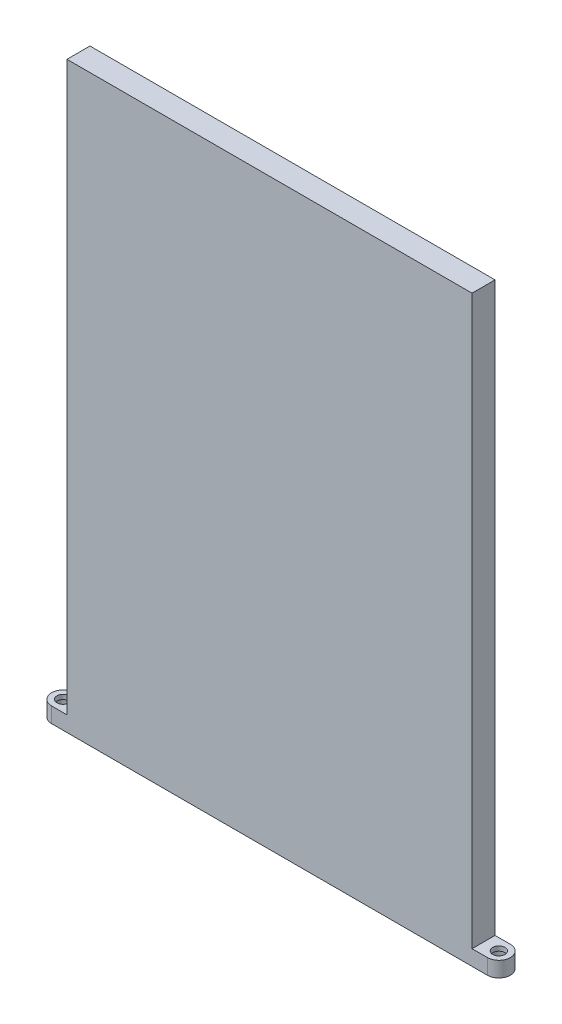
ISO-10303-21;
HEADER;
FILE_DESCRIPTION(('STEP AP214'),'2;1');
FILE_NAME('part.step','',(''),(''),'','','');
FILE_SCHEMA(('AUTOMOTIVE_DESIGN { 1 0 10303 214 1 1 1 1 }'));
ENDSEC;
DATA;
#1=APPLICATION_CONTEXT('core data for automotive mechanical design processes');
#2=APPLICATION_PROTOCOL_DEFINITION('international standard','automotive_design',2000,#1);
#3=PRODUCT_CONTEXT('',#1,'mechanical');
#4=PRODUCT('Part','Part','',(#3));
#5=PRODUCT_RELATED_PRODUCT_CATEGORY('part','',(#4));
#6=PRODUCT_DEFINITION_FORMATION('','',#4);
#7=PRODUCT_DEFINITION_CONTEXT('part definition',#1,'design');
#8=PRODUCT_DEFINITION('design','',#6,#7);
#9=PRODUCT_DEFINITION_SHAPE('','',#8);
#10=(LENGTH_UNIT() NAMED_UNIT(*) SI_UNIT(.MILLI.,.METRE.));
#11=(NAMED_UNIT(*) PLANE_ANGLE_UNIT() SI_UNIT($,.RADIAN.));
#12=(NAMED_UNIT(*) SI_UNIT($,.STERADIAN.) SOLID_ANGLE_UNIT());
#13=UNCERTAINTY_MEASURE_WITH_UNIT(LENGTH_MEASURE(1.E-05),#10,'distance_accuracy_value','');
#14=(GEOMETRIC_REPRESENTATION_CONTEXT(3) GLOBAL_UNCERTAINTY_ASSIGNED_CONTEXT((#13)) GLOBAL_UNIT_ASSIGNED_CONTEXT((#10,
#11,#12)) REPRESENTATION_CONTEXT('',''));
#15=CARTESIAN_POINT('',(0.,0.,0.));
#16=DIRECTION('',(0.,0.,1.));
#17=DIRECTION('',(1.,0.,0.));
#18=AXIS2_PLACEMENT_3D('',#15,#16,#17);
#19=CARTESIAN_POINT('',(-71.,-90.,3.75));
#20=DIRECTION('',(0.,-1.,0.));
#21=DIRECTION('',(1.,0.,0.));
#22=AXIS2_PLACEMENT_3D('',#19,#20,#21);
#23=CYLINDRICAL_SURFACE('',#22,2.);
#24=CARTESIAN_POINT('',(-71.,-90.,3.75));
#25=DIRECTION('',(0.,-1.,0.));
#26=DIRECTION('',(1.,0.,0.));
#27=AXIS2_PLACEMENT_3D('',#24,#25,#26);
#28=CIRCLE('',#27,2.);
#29=CARTESIAN_POINT('',(-69.,-90.,3.75));
#30=VERTEX_POINT('',#29);
#31=EDGE_CURVE('E142',#30,#30,#28,.T.);
#32=ORIENTED_EDGE('',*,*,#31,.F.);
#33=EDGE_LOOP('',(#32));
#34=FACE_BOUND('',#33,.T.);
#35=CARTESIAN_POINT('',(-71.,-91.5,3.75));
#36=DIRECTION('',(0.,-1.,0.));
#37=DIRECTION('',(1.,0.,0.));
#38=AXIS2_PLACEMENT_3D('',#35,#36,#37);
#39=CIRCLE('',#38,2.);
#40=CARTESIAN_POINT('',(-69.,-91.5,3.75));
#41=VERTEX_POINT('',#40);
#42=EDGE_CURVE('E202',#41,#41,#39,.F.);
#43=ORIENTED_EDGE('',*,*,#42,.F.);
#44=EDGE_LOOP('',(#43));
#45=FACE_BOUND('',#44,.T.);
#46=ADVANCED_FACE('F45',(#34,#45),#23,.F.);
#47=CARTESIAN_POINT('',(66.,-95.,7.5));
#48=DIRECTION('',(-1.,0.,0.));
#49=DIRECTION('',(0.,0.,1.));
#50=AXIS2_PLACEMENT_3D('',#47,#48,#49);
#51=PLANE('',#50);
#52=DIRECTION('',(0.,0.,1.));
#53=VECTOR('',#52,1.);
#54=CARTESIAN_POINT('',(66.,-90.,0.));
#55=LINE('',#54,#53);
#56=CARTESIAN_POINT('',(66.,-90.,0.));
#57=VERTEX_POINT('',#56);
#58=CARTESIAN_POINT('',(66.,-90.,7.5));
#59=VERTEX_POINT('',#58);
#60=EDGE_CURVE('E63',#57,#59,#55,.T.);
#61=ORIENTED_EDGE('',*,*,#60,.F.);
#62=DIRECTION('',(0.,1.,0.));
#63=VECTOR('',#62,1.);
#64=CARTESIAN_POINT('',(66.,-95.,0.));
#65=LINE('',#64,#63);
#66=CARTESIAN_POINT('',(66.,95.,0.));
#67=VERTEX_POINT('',#66);
#68=EDGE_CURVE('E195',#57,#67,#65,.T.);
#69=ORIENTED_EDGE('',*,*,#68,.T.);
#70=DIRECTION('',(0.,0.,-1.));
#71=VECTOR('',#70,1.);
#72=CARTESIAN_POINT('',(66.,95.,7.5));
#73=LINE('',#72,#71);
#74=CARTESIAN_POINT('',(66.,95.,7.5));
#75=VERTEX_POINT('',#74);
#76=EDGE_CURVE('E11',#75,#67,#73,.T.);
#77=ORIENTED_EDGE('',*,*,#76,.F.);
#78=DIRECTION('',(0.,1.,0.));
#79=VECTOR('',#78,1.);
#80=CARTESIAN_POINT('',(66.,-95.,7.5));
#81=LINE('',#80,#79);
#82=EDGE_CURVE('E184',#59,#75,#81,.T.);
#83=ORIENTED_EDGE('',*,*,#82,.F.);
#84=EDGE_LOOP('',(#61,#69,#77,#83));
#85=FACE_BOUND('',#84,.T.);
#86=ADVANCED_FACE('F250',(#85),#51,.F.);
#87=CARTESIAN_POINT('',(-66.,-95.,7.5));
#88=DIRECTION('',(1.,0.,0.));
#89=DIRECTION('',(0.,0.,-1.));
#90=AXIS2_PLACEMENT_3D('',#87,#88,#89);
#91=PLANE('',#90);
#92=DIRECTION('',(0.,0.,-1.));
#93=VECTOR('',#92,1.);
#94=CARTESIAN_POINT('',(-66.,-90.,0.));
#95=LINE('',#94,#93);
#96=CARTESIAN_POINT('',(-66.,-90.,7.5));
#97=VERTEX_POINT('',#96);
#98=CARTESIAN_POINT('',(-66.,-90.,0.));
#99=VERTEX_POINT('',#98);
#100=EDGE_CURVE('E71',#97,#99,#95,.T.);
#101=ORIENTED_EDGE('',*,*,#100,.F.);
#102=DIRECTION('',(0.,-1.,0.));
#103=VECTOR('',#102,1.);
#104=CARTESIAN_POINT('',(-66.,-95.,7.5));
#105=LINE('',#104,#103);
#106=CARTESIAN_POINT('',(-66.,95.,7.5));
#107=VERTEX_POINT('',#106);
#108=EDGE_CURVE('E178',#107,#97,#105,.T.);
#109=ORIENTED_EDGE('',*,*,#108,.F.);
#110=DIRECTION('',(0.,0.,-1.));
#111=VECTOR('',#110,1.);
#112=CARTESIAN_POINT('',(-66.,95.,7.5));
#113=LINE('',#112,#111);
#114=CARTESIAN_POINT('',(-66.,95.,0.));
#115=VERTEX_POINT('',#114);
#116=EDGE_CURVE('E55',#107,#115,#113,.T.);
#117=ORIENTED_EDGE('',*,*,#116,.T.);
#118=DIRECTION('',(0.,-1.,0.));
#119=VECTOR('',#118,1.);
#120=CARTESIAN_POINT('',(-66.,-95.,0.));
#121=LINE('',#120,#119);
#122=EDGE_CURVE('E174',#115,#99,#121,.T.);
#123=ORIENTED_EDGE('',*,*,#122,.T.);
#124=EDGE_LOOP('',(#101,#109,#117,#123));
#125=FACE_BOUND('',#124,.T.);
#126=ADVANCED_FACE('F47',(#125),#91,.F.);
#127=CARTESIAN_POINT('',(66.,-95.,7.5));
#128=DIRECTION('',(0.,1.,0.));
#129=DIRECTION('',(-1.,0.,0.));
#130=AXIS2_PLACEMENT_3D('',#127,#128,#129);
#131=PLANE('',#130);
#132=CARTESIAN_POINT('',(-71.,-95.,3.75));
#133=DIRECTION('',(0.,-1.,0.));
#134=DIRECTION('',(1.,0.,0.));
#135=AXIS2_PLACEMENT_3D('',#132,#133,#134);
#136=CIRCLE('',#135,3.00000000000001);
#137=CARTESIAN_POINT('',(-68.,-95.,3.75));
#138=VERTEX_POINT('',#137);
#139=EDGE_CURVE('E212',#138,#138,#136,.T.);
#140=ORIENTED_EDGE('',*,*,#139,.F.);
#141=EDGE_LOOP('',(#140));
#142=FACE_BOUND('',#141,.T.);
#143=CARTESIAN_POINT('',(71.,-95.,3.75));
#144=DIRECTION('',(0.,-1.,0.));
#145=DIRECTION('',(-1.,0.,0.));
#146=AXIS2_PLACEMENT_3D('',#143,#144,#145);
#147=CIRCLE('',#146,3.00000000000001);
#148=CARTESIAN_POINT('',(68.,-95.,3.75));
#149=VERTEX_POINT('',#148);
#150=EDGE_CURVE('E224',#149,#149,#147,.T.);
#151=ORIENTED_EDGE('',*,*,#150,.F.);
#152=EDGE_LOOP('',(#151));
#153=FACE_BOUND('',#152,.T.);
#154=DIRECTION('',(1.,0.,0.));
#155=VECTOR('',#154,1.);
#156=CARTESIAN_POINT('',(66.,-95.,0.));
#157=LINE('',#156,#155);
#158=CARTESIAN_POINT('',(-71.,-95.,0.));
#159=VERTEX_POINT('',#158);
#160=CARTESIAN_POINT('',(71.,-95.,0.));
#161=VERTEX_POINT('',#160);
#162=EDGE_CURVE('E192',#159,#161,#157,.T.);
#163=ORIENTED_EDGE('',*,*,#162,.T.);
#164=CARTESIAN_POINT('',(71.,-95.,3.75));
#165=DIRECTION('',(0.,-1.,0.));
#166=DIRECTION('',(1.,0.,0.));
#167=AXIS2_PLACEMENT_3D('',#164,#165,#166);
#168=CIRCLE('',#167,3.75);
#169=CARTESIAN_POINT('',(71.,-95.,7.5));
#170=VERTEX_POINT('',#169);
#171=EDGE_CURVE('E139',#170,#161,#168,.F.);
#172=ORIENTED_EDGE('',*,*,#171,.F.);
#173=DIRECTION('',(1.,0.,0.));
#174=VECTOR('',#173,1.);
#175=CARTESIAN_POINT('',(66.,-95.,7.5));
#176=LINE('',#175,#174);
#177=CARTESIAN_POINT('',(-71.,-95.,7.5));
#178=VERTEX_POINT('',#177);
#179=EDGE_CURVE('E127',#178,#170,#176,.T.);
#180=ORIENTED_EDGE('',*,*,#179,.F.);
#181=CARTESIAN_POINT('',(-71.,-95.,3.75));
#182=DIRECTION('',(0.,-1.,0.));
#183=DIRECTION('',(1.,0.,0.));
#184=AXIS2_PLACEMENT_3D('',#181,#182,#183);
#185=CIRCLE('',#184,3.75);
#186=EDGE_CURVE('E153',#159,#178,#185,.F.);
#187=ORIENTED_EDGE('',*,*,#186,.F.);
#188=EDGE_LOOP('',(#163,#172,#180,#187));
#189=FACE_BOUND('',#188,.T.);
#190=ADVANCED_FACE('F273',(#142,#153,#189),#131,.F.);
#191=CARTESIAN_POINT('',(66.,95.,7.5));
#192=DIRECTION('',(0.,-1.,0.));
#193=DIRECTION('',(1.,0.,0.));
#194=AXIS2_PLACEMENT_3D('',#191,#192,#193);
#195=PLANE('',#194);
#196=DIRECTION('',(-1.,0.,0.));
#197=VECTOR('',#196,1.);
#198=CARTESIAN_POINT('',(66.,95.,0.));
#199=LINE('',#198,#197);
#200=EDGE_CURVE('E181',#67,#115,#199,.T.);
#201=ORIENTED_EDGE('',*,*,#200,.T.);
#202=ORIENTED_EDGE('',*,*,#116,.F.);
#203=DIRECTION('',(-1.,0.,0.));
#204=VECTOR('',#203,1.);
#205=CARTESIAN_POINT('',(66.,95.,7.5));
#206=LINE('',#205,#204);
#207=EDGE_CURVE('E187',#75,#107,#206,.T.);
#208=ORIENTED_EDGE('',*,*,#207,.F.);
#209=ORIENTED_EDGE('',*,*,#76,.T.);
#210=EDGE_LOOP('',(#201,#202,#208,#209));
#211=FACE_BOUND('',#210,.T.);
#212=ADVANCED_FACE('F276',(#211),#195,.F.);
#213=CARTESIAN_POINT('',(0.,0.,7.5));
#214=DIRECTION('',(0.,0.,1.));
#215=DIRECTION('',(1.,0.,0.));
#216=AXIS2_PLACEMENT_3D('',#213,#214,#215);
#217=PLANE('',#216);
#218=ORIENTED_EDGE('',*,*,#108,.T.);
#219=DIRECTION('',(-1.,0.,0.));
#220=VECTOR('',#219,1.);
#221=CARTESIAN_POINT('',(0.,-90.,7.5));
#222=LINE('',#221,#220);
#223=CARTESIAN_POINT('',(-71.,-90.,7.5));
#224=VERTEX_POINT('',#223);
#225=EDGE_CURVE('E163',#97,#224,#222,.T.);
#226=ORIENTED_EDGE('',*,*,#225,.T.);
#227=DIRECTION('',(0.,-1.,0.));
#228=VECTOR('',#227,1.);
#229=CARTESIAN_POINT('',(-71.,-90.,7.5));
#230=LINE('',#229,#228);
#231=EDGE_CURVE('E171',#224,#178,#230,.T.);
#232=ORIENTED_EDGE('',*,*,#231,.T.);
#233=ORIENTED_EDGE('',*,*,#179,.T.);
#234=DIRECTION('',(0.,-1.,0.));
#235=VECTOR('',#234,1.);
#236=CARTESIAN_POINT('',(71.,-90.,7.5));
#237=LINE('',#236,#235);
#238=CARTESIAN_POINT('',(71.,-90.,7.5));
#239=VERTEX_POINT('',#238);
#240=EDGE_CURVE('E124',#239,#170,#237,.T.);
#241=ORIENTED_EDGE('',*,*,#240,.F.);
#242=DIRECTION('',(1.,0.,0.));
#243=VECTOR('',#242,1.);
#244=CARTESIAN_POINT('',(0.,-90.,7.49999999999999));
#245=LINE('',#244,#243);
#246=EDGE_CURVE('E113',#59,#239,#245,.T.);
#247=ORIENTED_EDGE('',*,*,#246,.F.);
#248=ORIENTED_EDGE('',*,*,#82,.T.);
#249=ORIENTED_EDGE('',*,*,#207,.T.);
#250=EDGE_LOOP('',(#218,#226,#232,#233,#241,#247,#248,#249));
#251=FACE_BOUND('',#250,.T.);
#252=ADVANCED_FACE('F125',(#251),#217,.T.);
#253=CARTESIAN_POINT('',(0.,0.,0.));
#254=DIRECTION('',(0.,0.,1.));
#255=DIRECTION('',(1.,0.,0.));
#256=AXIS2_PLACEMENT_3D('',#253,#254,#255);
#257=PLANE('',#256);
#258=ORIENTED_EDGE('',*,*,#122,.F.);
#259=ORIENTED_EDGE('',*,*,#200,.F.);
#260=ORIENTED_EDGE('',*,*,#68,.F.);
#261=DIRECTION('',(1.,0.,0.));
#262=VECTOR('',#261,1.);
#263=CARTESIAN_POINT('',(0.,-90.,0.));
#264=LINE('',#263,#262);
#265=CARTESIAN_POINT('',(71.,-90.,0.));
#266=VERTEX_POINT('',#265);
#267=EDGE_CURVE('E133',#57,#266,#264,.T.);
#268=ORIENTED_EDGE('',*,*,#267,.T.);
#269=DIRECTION('',(0.,-1.,0.));
#270=VECTOR('',#269,1.);
#271=CARTESIAN_POINT('',(71.,-90.,0.));
#272=LINE('',#271,#270);
#273=EDGE_CURVE('E132',#266,#161,#272,.T.);
#274=ORIENTED_EDGE('',*,*,#273,.T.);
#275=ORIENTED_EDGE('',*,*,#162,.F.);
#276=DIRECTION('',(0.,-1.,0.));
#277=VECTOR('',#276,1.);
#278=CARTESIAN_POINT('',(-71.,-90.,0.));
#279=LINE('',#278,#277);
#280=CARTESIAN_POINT('',(-71.,-90.,0.));
#281=VERTEX_POINT('',#280);
#282=EDGE_CURVE('E167',#281,#159,#279,.T.);
#283=ORIENTED_EDGE('',*,*,#282,.F.);
#284=DIRECTION('',(-1.,0.,0.));
#285=VECTOR('',#284,1.);
#286=CARTESIAN_POINT('',(0.,-90.,0.));
#287=LINE('',#286,#285);
#288=EDGE_CURVE('E158',#99,#281,#287,.T.);
#289=ORIENTED_EDGE('',*,*,#288,.F.);
#290=EDGE_LOOP('',(#258,#259,#260,#268,#274,#275,#283,#289));
#291=FACE_BOUND('',#290,.T.);
#292=ADVANCED_FACE('F283',(#291),#257,.F.);
#293=CARTESIAN_POINT('',(-71.,-90.,3.75));
#294=DIRECTION('',(0.,-1.,0.));
#295=DIRECTION('',(1.,0.,0.));
#296=AXIS2_PLACEMENT_3D('',#293,#294,#295);
#297=CYLINDRICAL_SURFACE('',#296,3.75);
#298=ORIENTED_EDGE('',*,*,#186,.T.);
#299=ORIENTED_EDGE('',*,*,#231,.F.);
#300=CARTESIAN_POINT('',(-71.,-90.,3.75));
#301=DIRECTION('',(0.,-1.,0.));
#302=DIRECTION('',(1.,0.,0.));
#303=AXIS2_PLACEMENT_3D('',#300,#301,#302);
#304=CIRCLE('',#303,3.75);
#305=EDGE_CURVE('E155',#281,#224,#304,.F.);
#306=ORIENTED_EDGE('',*,*,#305,.F.);
#307=ORIENTED_EDGE('',*,*,#282,.T.);
#308=EDGE_LOOP('',(#298,#299,#306,#307));
#309=FACE_BOUND('',#308,.T.);
#310=ADVANCED_FACE('F296',(#309),#297,.T.);
#311=CARTESIAN_POINT('',(0.,-90.,0.));
#312=DIRECTION('',(0.,-1.,0.));
#313=DIRECTION('',(1.,0.,0.));
#314=AXIS2_PLACEMENT_3D('',#311,#312,#313);
#315=PLANE('',#314);
#316=ORIENTED_EDGE('',*,*,#31,.T.);
#317=EDGE_LOOP('',(#316));
#318=FACE_BOUND('',#317,.T.);
#319=ORIENTED_EDGE('',*,*,#305,.T.);
#320=ORIENTED_EDGE('',*,*,#225,.F.);
#321=ORIENTED_EDGE('',*,*,#100,.T.);
#322=ORIENTED_EDGE('',*,*,#288,.T.);
#323=EDGE_LOOP('',(#319,#320,#321,#322));
#324=FACE_BOUND('',#323,.T.);
#325=ADVANCED_FACE('F291',(#318,#324),#315,.F.);
#326=CARTESIAN_POINT('',(71.,-90.,3.75));
#327=DIRECTION('',(0.,-1.,0.));
#328=DIRECTION('',(1.,0.,0.));
#329=AXIS2_PLACEMENT_3D('',#326,#327,#328);
#330=CYLINDRICAL_SURFACE('',#329,3.75);
#331=ORIENTED_EDGE('',*,*,#171,.T.);
#332=ORIENTED_EDGE('',*,*,#273,.F.);
#333=CARTESIAN_POINT('',(71.,-90.,3.75));
#334=DIRECTION('',(0.,-1.,0.));
#335=DIRECTION('',(1.,0.,0.));
#336=AXIS2_PLACEMENT_3D('',#333,#334,#335);
#337=CIRCLE('',#336,3.75);
#338=EDGE_CURVE('E118',#239,#266,#337,.F.);
#339=ORIENTED_EDGE('',*,*,#338,.F.);
#340=ORIENTED_EDGE('',*,*,#240,.T.);
#341=EDGE_LOOP('',(#331,#332,#339,#340));
#342=FACE_BOUND('',#341,.T.);
#343=ADVANCED_FACE('F135',(#342),#330,.T.);
#344=CARTESIAN_POINT('',(0.,-90.,0.));
#345=DIRECTION('',(0.,-1.,0.));
#346=DIRECTION('',(1.,0.,0.));
#347=AXIS2_PLACEMENT_3D('',#344,#345,#346);
#348=PLANE('',#347);
#349=CARTESIAN_POINT('',(71.,-90.,3.75));
#350=DIRECTION('',(0.,-1.,0.));
#351=DIRECTION('',(1.,0.,0.));
#352=AXIS2_PLACEMENT_3D('',#349,#350,#351);
#353=CIRCLE('',#352,2.);
#354=CARTESIAN_POINT('',(73.,-90.,3.75));
#355=VERTEX_POINT('',#354);
#356=EDGE_CURVE('E145',#355,#355,#353,.T.);
#357=ORIENTED_EDGE('',*,*,#356,.T.);
#358=EDGE_LOOP('',(#357));
#359=FACE_BOUND('',#358,.T.);
#360=ORIENTED_EDGE('',*,*,#338,.T.);
#361=ORIENTED_EDGE('',*,*,#267,.F.);
#362=ORIENTED_EDGE('',*,*,#60,.T.);
#363=ORIENTED_EDGE('',*,*,#246,.T.);
#364=EDGE_LOOP('',(#360,#361,#362,#363));
#365=FACE_BOUND('',#364,.T.);
#366=ADVANCED_FACE('F115',(#359,#365),#348,.F.);
#367=CARTESIAN_POINT('',(71.,-90.,3.75));
#368=DIRECTION('',(0.,-1.,0.));
#369=DIRECTION('',(1.,0.,0.));
#370=AXIS2_PLACEMENT_3D('',#367,#368,#369);
#371=CYLINDRICAL_SURFACE('',#370,2.);
#372=CARTESIAN_POINT('',(71.,-91.5,3.75));
#373=DIRECTION('',(0.,1.,0.));
#374=DIRECTION('',(-1.,0.,0.));
#375=AXIS2_PLACEMENT_3D('',#372,#373,#374);
#376=CIRCLE('',#375,2.);
#377=CARTESIAN_POINT('',(69.,-91.5,3.75));
#378=VERTEX_POINT('',#377);
#379=EDGE_CURVE('E49',#378,#378,#376,.F.);
#380=ORIENTED_EDGE('',*,*,#379,.T.);
#381=EDGE_LOOP('',(#380));
#382=FACE_BOUND('',#381,.T.);
#383=ORIENTED_EDGE('',*,*,#356,.F.);
#384=EDGE_LOOP('',(#383));
#385=FACE_BOUND('',#384,.T.);
#386=ADVANCED_FACE('F236',(#382,#385),#371,.F.);
#387=CARTESIAN_POINT('',(-71.,-91.5,3.75));
#388=DIRECTION('',(0.,-1.,0.));
#389=DIRECTION('',(1.,0.,0.));
#390=AXIS2_PLACEMENT_3D('',#387,#388,#389);
#391=PLANE('',#390);
#392=CARTESIAN_POINT('',(-71.,-91.5,3.75));
#393=DIRECTION('',(0.,-1.,0.));
#394=DIRECTION('',(1.,0.,0.));
#395=AXIS2_PLACEMENT_3D('',#392,#393,#394);
#396=CIRCLE('',#395,3.00000000000001);
#397=CARTESIAN_POINT('',(-68.,-91.5,3.75));
#398=VERTEX_POINT('',#397);
#399=EDGE_CURVE('E205',#398,#398,#396,.T.);
#400=ORIENTED_EDGE('',*,*,#399,.T.);
#401=EDGE_LOOP('',(#400));
#402=FACE_BOUND('',#401,.T.);
#403=ORIENTED_EDGE('',*,*,#42,.T.);
#404=EDGE_LOOP('',(#403));
#405=FACE_BOUND('',#404,.T.);
#406=ADVANCED_FACE('F238',(#402,#405),#391,.T.);
#407=CARTESIAN_POINT('',(-71.,-91.5,3.75));
#408=DIRECTION('',(0.,-1.,0.));
#409=DIRECTION('',(1.,0.,0.));
#410=AXIS2_PLACEMENT_3D('',#407,#408,#409);
#411=CYLINDRICAL_SURFACE('',#410,3.00000000000001);
#412=ORIENTED_EDGE('',*,*,#399,.F.);
#413=EDGE_LOOP('',(#412));
#414=FACE_BOUND('',#413,.T.);
#415=ORIENTED_EDGE('',*,*,#139,.T.);
#416=EDGE_LOOP('',(#415));
#417=FACE_BOUND('',#416,.T.);
#418=ADVANCED_FACE('F245',(#414,#417),#411,.F.);
#419=CARTESIAN_POINT('',(71.,-91.5,3.75));
#420=DIRECTION('',(0.,1.,0.));
#421=DIRECTION('',(-1.,0.,0.));
#422=AXIS2_PLACEMENT_3D('',#419,#420,#421);
#423=PLANE('',#422);
#424=CARTESIAN_POINT('',(71.,-91.5,3.75));
#425=DIRECTION('',(0.,-1.,0.));
#426=DIRECTION('',(-1.,0.,0.));
#427=AXIS2_PLACEMENT_3D('',#424,#425,#426);
#428=CIRCLE('',#427,3.00000000000001);
#429=CARTESIAN_POINT('',(68.,-91.5,3.75));
#430=VERTEX_POINT('',#429);
#431=EDGE_CURVE('E218',#430,#430,#428,.T.);
#432=ORIENTED_EDGE('',*,*,#431,.T.);
#433=EDGE_LOOP('',(#432));
#434=FACE_BOUND('',#433,.T.);
#435=ORIENTED_EDGE('',*,*,#379,.F.);
#436=EDGE_LOOP('',(#435));
#437=FACE_BOUND('',#436,.T.);
#438=ADVANCED_FACE('F261',(#434,#437),#423,.F.);
#439=CARTESIAN_POINT('',(71.,-91.5,3.75));
#440=DIRECTION('',(0.,-1.,0.));
#441=DIRECTION('',(1.,0.,0.));
#442=AXIS2_PLACEMENT_3D('',#439,#440,#441);
#443=CYLINDRICAL_SURFACE('',#442,3.00000000000001);
#444=ORIENTED_EDGE('',*,*,#431,.F.);
#445=EDGE_LOOP('',(#444));
#446=FACE_BOUND('',#445,.T.);
#447=ORIENTED_EDGE('',*,*,#150,.T.);
#448=EDGE_LOOP('',(#447));
#449=FACE_BOUND('',#448,.T.);
#450=ADVANCED_FACE('F258',(#446,#449),#443,.F.);
#451=CLOSED_SHELL('',(#46,#86,#126,#190,#212,#252,#292,#310,#325,#343,#366,#386,#406,#418,#438,#450));
#452=MANIFOLD_SOLID_BREP('B2',#451);
#453=ADVANCED_BREP_SHAPE_REPRESENTATION('',(#18,#452),#14);
#454=SHAPE_DEFINITION_REPRESENTATION(#9,#453);
ENDSEC;
END-ISO-10303-21;
